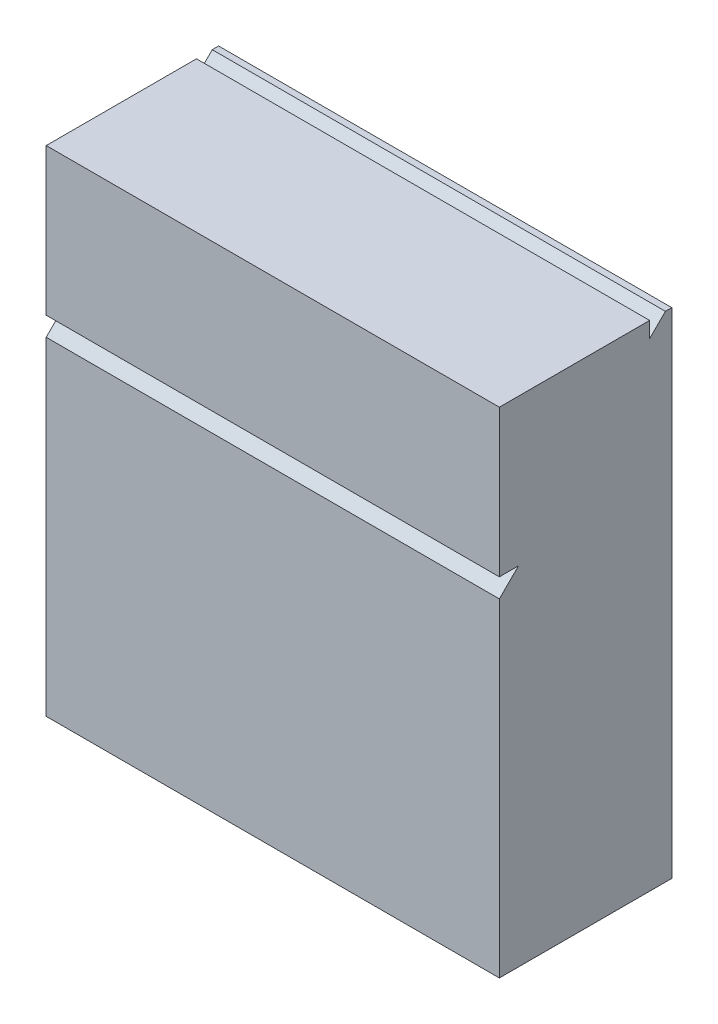
ISO-10303-21;
HEADER;
FILE_DESCRIPTION(('STEP AP214'),'2;1');
FILE_NAME('part.step','',(''),(''),'','','');
FILE_SCHEMA(('AUTOMOTIVE_DESIGN { 1 0 10303 214 1 1 1 1 }'));
ENDSEC;
DATA;
#1=APPLICATION_CONTEXT('core data for automotive mechanical design processes');
#2=APPLICATION_PROTOCOL_DEFINITION('international standard','automotive_design',2000,#1);
#3=PRODUCT_CONTEXT('',#1,'mechanical');
#4=PRODUCT('Part','Part','',(#3));
#5=PRODUCT_RELATED_PRODUCT_CATEGORY('part','',(#4));
#6=PRODUCT_DEFINITION_FORMATION('','',#4);
#7=PRODUCT_DEFINITION_CONTEXT('part definition',#1,'design');
#8=PRODUCT_DEFINITION('design','',#6,#7);
#9=PRODUCT_DEFINITION_SHAPE('','',#8);
#10=(LENGTH_UNIT() NAMED_UNIT(*) SI_UNIT(.MILLI.,.METRE.));
#11=(NAMED_UNIT(*) PLANE_ANGLE_UNIT() SI_UNIT($,.RADIAN.));
#12=(NAMED_UNIT(*) SI_UNIT($,.STERADIAN.) SOLID_ANGLE_UNIT());
#13=UNCERTAINTY_MEASURE_WITH_UNIT(LENGTH_MEASURE(1.E-05),#10,'distance_accuracy_value','');
#14=(GEOMETRIC_REPRESENTATION_CONTEXT(3) GLOBAL_UNCERTAINTY_ASSIGNED_CONTEXT((#13)) GLOBAL_UNIT_ASSIGNED_CONTEXT((#10,
#11,#12)) REPRESENTATION_CONTEXT('',''));
#15=CARTESIAN_POINT('',(0.,0.,0.));
#16=DIRECTION('',(0.,0.,1.));
#17=DIRECTION('',(1.,0.,0.));
#18=AXIS2_PLACEMENT_3D('',#15,#16,#17);
#19=CARTESIAN_POINT('',(53.0207099423903,12.,0.309982694473401));
#20=DIRECTION('',(0.,-0.707106781186543,-0.707106781186552));
#21=DIRECTION('',(0.,0.707106781186552,-0.707106781186543));
#22=AXIS2_PLACEMENT_3D('',#19,#20,#21);
#23=PLANE('',#22);
#24=DIRECTION('',(1.,0.,0.));
#25=VECTOR('',#24,1.);
#26=CARTESIAN_POINT('',(-11.,4.8658445420559,7.44413815241742));
#27=LINE('',#26,#25);
#28=CARTESIAN_POINT('',(-11.,4.8658445420559,7.44413815241742));
#29=VERTEX_POINT('',#28);
#30=CARTESIAN_POINT('',(11.,4.8658445420559,7.44413815241742));
#31=VERTEX_POINT('',#30);
#32=EDGE_CURVE('E123',#29,#31,#27,.T.);
#33=ORIENTED_EDGE('',*,*,#32,.F.);
#34=DIRECTION('',(0.,0.707106781186552,-0.707106781186543));
#35=VECTOR('',#34,1.);
#36=CARTESIAN_POINT('',(-11.,-4.03050865276344,16.3404913472367));
#37=LINE('',#36,#35);
#38=CARTESIAN_POINT('',(-11.,3.93898269447331,8.371));
#39=VERTEX_POINT('',#38);
#40=EDGE_CURVE('E59',#39,#29,#37,.T.);
#41=ORIENTED_EDGE('',*,*,#40,.F.);
#42=DIRECTION('',(-1.,0.,0.));
#43=VECTOR('',#42,1.);
#44=CARTESIAN_POINT('',(0.,3.93898269447331,8.371));
#45=LINE('',#44,#43);
#46=CARTESIAN_POINT('',(11.,3.93898269447331,8.371));
#47=VERTEX_POINT('',#46);
#48=EDGE_CURVE('E11',#47,#39,#45,.T.);
#49=ORIENTED_EDGE('',*,*,#48,.F.);
#50=DIRECTION('',(0.,-0.707106781186552,0.707106781186543));
#51=VECTOR('',#50,1.);
#52=CARTESIAN_POINT('',(11.,-4.03050865276344,16.3404913472367));
#53=LINE('',#52,#51);
#54=EDGE_CURVE('E160',#31,#47,#53,.T.);
#55=ORIENTED_EDGE('',*,*,#54,.F.);
#56=EDGE_LOOP('',(#33,#41,#49,#55));
#57=FACE_BOUND('',#56,.T.);
#58=ADVANCED_FACE('F36',(#57),#23,.F.);
#59=CARTESIAN_POINT('',(11.,-12.,8.371));
#60=DIRECTION('',(-1.,0.,0.));
#61=DIRECTION('',(0.,0.,1.));
#62=AXIS2_PLACEMENT_3D('',#59,#60,#61);
#63=PLANE('',#62);
#64=DIRECTION('',(0.,0.,-1.));
#65=VECTOR('',#64,1.);
#66=CARTESIAN_POINT('',(11.,12.,8.371));
#67=LINE('',#66,#65);
#68=CARTESIAN_POINT('',(11.,12.,0.309982694473401));
#69=VERTEX_POINT('',#68);
#70=CARTESIAN_POINT('',(11.,12.,0.));
#71=VERTEX_POINT('',#70);
#72=EDGE_CURVE('E44',#69,#71,#67,.T.);
#73=ORIENTED_EDGE('',*,*,#72,.F.);
#74=CARTESIAN_POINT('',(11.,11.2346101337256,1.07537256074782));
#75=VERTEX_POINT('',#74);
#76=EDGE_CURVE('E161',#69,#75,#53,.T.);
#77=ORIENTED_EDGE('',*,*,#76,.T.);
#78=DIRECTION('',(0.,1.,0.));
#79=VECTOR('',#78,1.);
#80=CARTESIAN_POINT('',(11.,12.,1.07537256074782));
#81=LINE('',#80,#79);
#82=CARTESIAN_POINT('',(11.,12.,1.07537256074782));
#83=VERTEX_POINT('',#82);
#84=EDGE_CURVE('E51',#75,#83,#81,.T.);
#85=ORIENTED_EDGE('',*,*,#84,.T.);
#86=DIRECTION('',(0.,0.,1.));
#87=VECTOR('',#86,1.);
#88=CARTESIAN_POINT('',(11.,12.,8.371));
#89=LINE('',#88,#87);
#90=CARTESIAN_POINT('',(11.,12.,8.371));
#91=VERTEX_POINT('',#90);
#92=EDGE_CURVE('E137',#83,#91,#89,.T.);
#93=ORIENTED_EDGE('',*,*,#92,.T.);
#94=DIRECTION('',(0.,-1.,0.));
#95=VECTOR('',#94,1.);
#96=CARTESIAN_POINT('',(11.,12.,8.371));
#97=LINE('',#96,#95);
#98=CARTESIAN_POINT('',(11.,4.8658445420559,8.371));
#99=VERTEX_POINT('',#98);
#100=EDGE_CURVE('E145',#91,#99,#97,.T.);
#101=ORIENTED_EDGE('',*,*,#100,.T.);
#102=DIRECTION('',(0.,0.,-1.));
#103=VECTOR('',#102,1.);
#104=CARTESIAN_POINT('',(11.,4.8658445420559,8.371));
#105=LINE('',#104,#103);
#106=EDGE_CURVE('E118',#99,#31,#105,.T.);
#107=ORIENTED_EDGE('',*,*,#106,.T.);
#108=ORIENTED_EDGE('',*,*,#54,.T.);
#109=DIRECTION('',(0.,1.,0.));
#110=VECTOR('',#109,1.);
#111=CARTESIAN_POINT('',(11.,-12.,8.371));
#112=LINE('',#111,#110);
#113=CARTESIAN_POINT('',(11.,-12.,8.371));
#114=VERTEX_POINT('',#113);
#115=EDGE_CURVE('E165',#114,#47,#112,.T.);
#116=ORIENTED_EDGE('',*,*,#115,.F.);
#117=DIRECTION('',(0.,0.,-1.));
#118=VECTOR('',#117,1.);
#119=CARTESIAN_POINT('',(11.,-12.,8.371));
#120=LINE('',#119,#118);
#121=CARTESIAN_POINT('',(11.,-12.,0.));
#122=VERTEX_POINT('',#121);
#123=EDGE_CURVE('E173',#114,#122,#120,.T.);
#124=ORIENTED_EDGE('',*,*,#123,.T.);
#125=DIRECTION('',(0.,1.,0.));
#126=VECTOR('',#125,1.);
#127=CARTESIAN_POINT('',(11.,-12.,0.));
#128=LINE('',#127,#126);
#129=EDGE_CURVE('E164',#122,#71,#128,.T.);
#130=ORIENTED_EDGE('',*,*,#129,.T.);
#131=EDGE_LOOP('',(#73,#77,#85,#93,#101,#107,#108,#116,#124,#130));
#132=FACE_BOUND('',#131,.T.);
#133=ADVANCED_FACE('F38',(#132),#63,.F.);
#134=CARTESIAN_POINT('',(-11.,12.,8.371));
#135=DIRECTION('',(0.,-1.,0.));
#136=DIRECTION('',(0.,0.,-1.));
#137=AXIS2_PLACEMENT_3D('',#134,#135,#136);
#138=PLANE('',#137);
#139=DIRECTION('',(0.,0.,-1.));
#140=VECTOR('',#139,1.);
#141=CARTESIAN_POINT('',(-11.,12.,8.371));
#142=LINE('',#141,#140);
#143=CARTESIAN_POINT('',(-11.,12.,0.309982694473401));
#144=VERTEX_POINT('',#143);
#145=CARTESIAN_POINT('',(-11.,12.,0.));
#146=VERTEX_POINT('',#145);
#147=EDGE_CURVE('E187',#144,#146,#142,.T.);
#148=ORIENTED_EDGE('',*,*,#147,.F.);
#149=DIRECTION('',(-1.,0.,0.));
#150=VECTOR('',#149,1.);
#151=CARTESIAN_POINT('',(53.0207099423903,12.,0.309982694473401));
#152=LINE('',#151,#150);
#153=EDGE_CURVE('E150',#69,#144,#152,.T.);
#154=ORIENTED_EDGE('',*,*,#153,.F.);
#155=ORIENTED_EDGE('',*,*,#72,.T.);
#156=DIRECTION('',(-1.,0.,0.));
#157=VECTOR('',#156,1.);
#158=CARTESIAN_POINT('',(-11.,12.,0.));
#159=LINE('',#158,#157);
#160=EDGE_CURVE('E176',#71,#146,#159,.T.);
#161=ORIENTED_EDGE('',*,*,#160,.T.);
#162=EDGE_LOOP('',(#148,#154,#155,#161));
#163=FACE_BOUND('',#162,.T.);
#164=ADVANCED_FACE('F193',(#163),#138,.F.);
#165=CARTESIAN_POINT('',(-11.,-12.,8.371));
#166=DIRECTION('',(1.,0.,0.));
#167=DIRECTION('',(0.,0.,-1.));
#168=AXIS2_PLACEMENT_3D('',#165,#166,#167);
#169=PLANE('',#168);
#170=DIRECTION('',(0.,-1.,0.));
#171=VECTOR('',#170,1.);
#172=CARTESIAN_POINT('',(-11.,-12.,8.371));
#173=LINE('',#172,#171);
#174=CARTESIAN_POINT('',(-11.,-12.,8.371));
#175=VERTEX_POINT('',#174);
#176=EDGE_CURVE('E168',#39,#175,#173,.T.);
#177=ORIENTED_EDGE('',*,*,#176,.F.);
#178=ORIENTED_EDGE('',*,*,#40,.T.);
#179=DIRECTION('',(0.,0.,-1.));
#180=VECTOR('',#179,1.);
#181=CARTESIAN_POINT('',(-11.,4.8658445420559,8.371));
#182=LINE('',#181,#180);
#183=CARTESIAN_POINT('',(-11.,4.8658445420559,8.371));
#184=VERTEX_POINT('',#183);
#185=EDGE_CURVE('E116',#184,#29,#182,.T.);
#186=ORIENTED_EDGE('',*,*,#185,.F.);
#187=DIRECTION('',(0.,-1.,0.));
#188=VECTOR('',#187,1.);
#189=CARTESIAN_POINT('',(-11.,12.,8.371));
#190=LINE('',#189,#188);
#191=CARTESIAN_POINT('',(-11.,12.,8.371));
#192=VERTEX_POINT('',#191);
#193=EDGE_CURVE('E131',#192,#184,#190,.T.);
#194=ORIENTED_EDGE('',*,*,#193,.F.);
#195=DIRECTION('',(0.,0.,1.));
#196=VECTOR('',#195,1.);
#197=CARTESIAN_POINT('',(-11.,12.,8.371));
#198=LINE('',#197,#196);
#199=CARTESIAN_POINT('',(-11.,12.,1.07537256074782));
#200=VERTEX_POINT('',#199);
#201=EDGE_CURVE('E124',#200,#192,#198,.T.);
#202=ORIENTED_EDGE('',*,*,#201,.F.);
#203=DIRECTION('',(0.,1.,0.));
#204=VECTOR('',#203,1.);
#205=CARTESIAN_POINT('',(-11.,12.,1.07537256074782));
#206=LINE('',#205,#204);
#207=CARTESIAN_POINT('',(-11.,11.2346101337256,1.07537256074782));
#208=VERTEX_POINT('',#207);
#209=EDGE_CURVE('E133',#208,#200,#206,.T.);
#210=ORIENTED_EDGE('',*,*,#209,.F.);
#211=EDGE_CURVE('E158',#208,#144,#37,.T.);
#212=ORIENTED_EDGE('',*,*,#211,.T.);
#213=ORIENTED_EDGE('',*,*,#147,.T.);
#214=DIRECTION('',(0.,-1.,0.));
#215=VECTOR('',#214,1.);
#216=CARTESIAN_POINT('',(-11.,-12.,0.));
#217=LINE('',#216,#215);
#218=CARTESIAN_POINT('',(-11.,-12.,0.));
#219=VERTEX_POINT('',#218);
#220=EDGE_CURVE('E179',#146,#219,#217,.T.);
#221=ORIENTED_EDGE('',*,*,#220,.T.);
#222=DIRECTION('',(0.,0.,-1.));
#223=VECTOR('',#222,1.);
#224=CARTESIAN_POINT('',(-11.,-12.,8.371));
#225=LINE('',#224,#223);
#226=EDGE_CURVE('E184',#175,#219,#225,.T.);
#227=ORIENTED_EDGE('',*,*,#226,.F.);
#228=EDGE_LOOP('',(#177,#178,#186,#194,#202,#210,#212,#213,#221,#227));
#229=FACE_BOUND('',#228,.T.);
#230=ADVANCED_FACE('F129',(#229),#169,.F.);
#231=CARTESIAN_POINT('',(-11.,-12.,8.371));
#232=DIRECTION('',(0.,1.,0.));
#233=DIRECTION('',(0.,0.,1.));
#234=AXIS2_PLACEMENT_3D('',#231,#232,#233);
#235=PLANE('',#234);
#236=DIRECTION('',(1.,0.,0.));
#237=VECTOR('',#236,1.);
#238=CARTESIAN_POINT('',(-11.,-12.,0.));
#239=LINE('',#238,#237);
#240=EDGE_CURVE('E169',#219,#122,#239,.T.);
#241=ORIENTED_EDGE('',*,*,#240,.T.);
#242=ORIENTED_EDGE('',*,*,#123,.F.);
#243=DIRECTION('',(1.,0.,0.));
#244=VECTOR('',#243,1.);
#245=CARTESIAN_POINT('',(-11.,-12.,8.371));
#246=LINE('',#245,#244);
#247=EDGE_CURVE('E171',#175,#114,#246,.T.);
#248=ORIENTED_EDGE('',*,*,#247,.F.);
#249=ORIENTED_EDGE('',*,*,#226,.T.);
#250=EDGE_LOOP('',(#241,#242,#248,#249));
#251=FACE_BOUND('',#250,.T.);
#252=ADVANCED_FACE('F204',(#251),#235,.F.);
#253=CARTESIAN_POINT('',(0.,0.,8.371));
#254=DIRECTION('',(0.,0.,-1.));
#255=DIRECTION('',(-1.,0.,0.));
#256=AXIS2_PLACEMENT_3D('',#253,#254,#255);
#257=PLANE('',#256);
#258=ORIENTED_EDGE('',*,*,#115,.T.);
#259=ORIENTED_EDGE('',*,*,#48,.T.);
#260=ORIENTED_EDGE('',*,*,#176,.T.);
#261=ORIENTED_EDGE('',*,*,#247,.T.);
#262=EDGE_LOOP('',(#258,#259,#260,#261));
#263=FACE_BOUND('',#262,.T.);
#264=ADVANCED_FACE('F215',(#263),#257,.F.);
#265=CARTESIAN_POINT('',(0.,0.,0.));
#266=DIRECTION('',(0.,0.,-1.));
#267=DIRECTION('',(-1.,0.,0.));
#268=AXIS2_PLACEMENT_3D('',#265,#266,#267);
#269=PLANE('',#268);
#270=ORIENTED_EDGE('',*,*,#129,.F.);
#271=ORIENTED_EDGE('',*,*,#240,.F.);
#272=ORIENTED_EDGE('',*,*,#220,.F.);
#273=ORIENTED_EDGE('',*,*,#160,.F.);
#274=EDGE_LOOP('',(#270,#271,#272,#273));
#275=FACE_BOUND('',#274,.T.);
#276=ADVANCED_FACE('F198',(#275),#269,.T.);
#277=ORIENTED_EDGE('',*,*,#211,.F.);
#278=DIRECTION('',(1.,0.,0.));
#279=VECTOR('',#278,1.);
#280=CARTESIAN_POINT('',(-11.,11.2346101337256,1.07537256074782));
#281=LINE('',#280,#279);
#282=EDGE_CURVE('E153',#208,#75,#281,.T.);
#283=ORIENTED_EDGE('',*,*,#282,.T.);
#284=ORIENTED_EDGE('',*,*,#76,.F.);
#285=ORIENTED_EDGE('',*,*,#153,.T.);
#286=EDGE_LOOP('',(#277,#283,#284,#285));
#287=FACE_BOUND('',#286,.T.);
#288=ADVANCED_FACE('F209',(#287),#23,.F.);
#289=CARTESIAN_POINT('',(-11.,12.,8.371));
#290=DIRECTION('',(0.,0.,1.));
#291=DIRECTION('',(1.,0.,0.));
#292=AXIS2_PLACEMENT_3D('',#289,#290,#291);
#293=PLANE('',#292);
#294=ORIENTED_EDGE('',*,*,#100,.F.);
#295=DIRECTION('',(1.,0.,0.));
#296=VECTOR('',#295,1.);
#297=CARTESIAN_POINT('',(-11.,12.,8.371));
#298=LINE('',#297,#296);
#299=EDGE_CURVE('E136',#192,#91,#298,.T.);
#300=ORIENTED_EDGE('',*,*,#299,.F.);
#301=ORIENTED_EDGE('',*,*,#193,.T.);
#302=DIRECTION('',(1.,0.,0.));
#303=VECTOR('',#302,1.);
#304=CARTESIAN_POINT('',(-11.,4.8658445420559,8.371));
#305=LINE('',#304,#303);
#306=EDGE_CURVE('E113',#184,#99,#305,.T.);
#307=ORIENTED_EDGE('',*,*,#306,.T.);
#308=EDGE_LOOP('',(#294,#300,#301,#307));
#309=FACE_BOUND('',#308,.T.);
#310=ADVANCED_FACE('F135',(#309),#293,.T.);
#311=CARTESIAN_POINT('',(-11.,12.,8.371));
#312=DIRECTION('',(0.,1.,0.));
#313=DIRECTION('',(0.,0.,1.));
#314=AXIS2_PLACEMENT_3D('',#311,#312,#313);
#315=PLANE('',#314);
#316=ORIENTED_EDGE('',*,*,#92,.F.);
#317=DIRECTION('',(1.,0.,0.));
#318=VECTOR('',#317,1.);
#319=CARTESIAN_POINT('',(-11.,12.,1.07537256074782));
#320=LINE('',#319,#318);
#321=EDGE_CURVE('E151',#200,#83,#320,.T.);
#322=ORIENTED_EDGE('',*,*,#321,.F.);
#323=ORIENTED_EDGE('',*,*,#201,.T.);
#324=ORIENTED_EDGE('',*,*,#299,.T.);
#325=EDGE_LOOP('',(#316,#322,#323,#324));
#326=FACE_BOUND('',#325,.T.);
#327=ADVANCED_FACE('F212',(#326),#315,.T.);
#328=CARTESIAN_POINT('',(-11.,12.,1.07537256074782));
#329=DIRECTION('',(0.,0.,-1.));
#330=DIRECTION('',(0.,1.,0.));
#331=AXIS2_PLACEMENT_3D('',#328,#329,#330);
#332=PLANE('',#331);
#333=ORIENTED_EDGE('',*,*,#84,.F.);
#334=ORIENTED_EDGE('',*,*,#282,.F.);
#335=ORIENTED_EDGE('',*,*,#209,.T.);
#336=ORIENTED_EDGE('',*,*,#321,.T.);
#337=EDGE_LOOP('',(#333,#334,#335,#336));
#338=FACE_BOUND('',#337,.T.);
#339=ADVANCED_FACE('F237',(#338),#332,.T.);
#340=CARTESIAN_POINT('',(-11.,4.8658445420559,8.371));
#341=DIRECTION('',(0.,-1.,0.));
#342=DIRECTION('',(0.,0.,-1.));
#343=AXIS2_PLACEMENT_3D('',#340,#341,#342);
#344=PLANE('',#343);
#345=ORIENTED_EDGE('',*,*,#106,.F.);
#346=ORIENTED_EDGE('',*,*,#306,.F.);
#347=ORIENTED_EDGE('',*,*,#185,.T.);
#348=ORIENTED_EDGE('',*,*,#32,.T.);
#349=EDGE_LOOP('',(#345,#346,#347,#348));
#350=FACE_BOUND('',#349,.T.);
#351=ADVANCED_FACE('F115',(#350),#344,.T.);
#352=CLOSED_SHELL('',(#58,#133,#164,#230,#252,#264,#276,#288,#310,#327,#339,#351));
#353=MANIFOLD_SOLID_BREP('B2',#352);
#354=ADVANCED_BREP_SHAPE_REPRESENTATION('',(#18,#353),#14);
#355=SHAPE_DEFINITION_REPRESENTATION(#9,#354);
ENDSEC;
END-ISO-10303-21;
